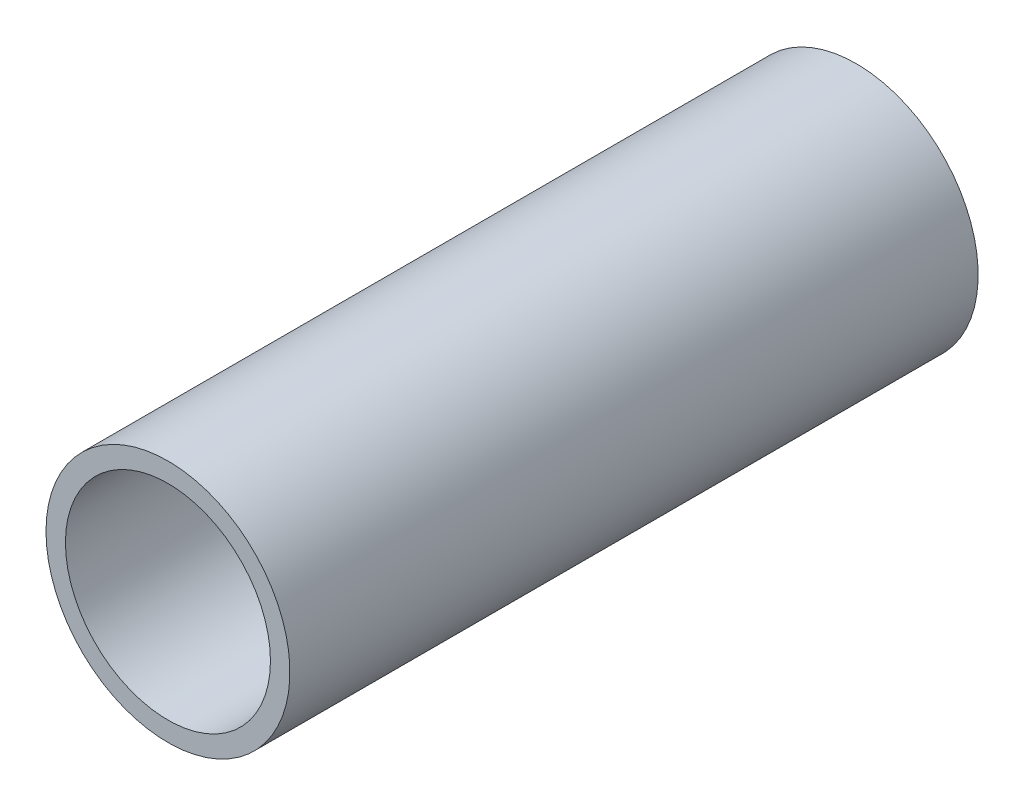
ISO-10303-21;
HEADER;
FILE_DESCRIPTION(('STEP AP214'),'2;1');
FILE_NAME('part.step','',(''),(''),'','','');
FILE_SCHEMA(('AUTOMOTIVE_DESIGN { 1 0 10303 214 1 1 1 1 }'));
ENDSEC;
DATA;
#1=APPLICATION_CONTEXT('core data for automotive mechanical design processes');
#2=APPLICATION_PROTOCOL_DEFINITION('international standard','automotive_design',2000,#1);
#3=PRODUCT_CONTEXT('',#1,'mechanical');
#4=PRODUCT('Part','Part','',(#3));
#5=PRODUCT_RELATED_PRODUCT_CATEGORY('part','',(#4));
#6=PRODUCT_DEFINITION_FORMATION('','',#4);
#7=PRODUCT_DEFINITION_CONTEXT('part definition',#1,'design');
#8=PRODUCT_DEFINITION('design','',#6,#7);
#9=PRODUCT_DEFINITION_SHAPE('','',#8);
#10=(LENGTH_UNIT() NAMED_UNIT(*) SI_UNIT(.MILLI.,.METRE.));
#11=(NAMED_UNIT(*) PLANE_ANGLE_UNIT() SI_UNIT($,.RADIAN.));
#12=(NAMED_UNIT(*) SI_UNIT($,.STERADIAN.) SOLID_ANGLE_UNIT());
#13=UNCERTAINTY_MEASURE_WITH_UNIT(LENGTH_MEASURE(1.E-05),#10,'distance_accuracy_value','');
#14=(GEOMETRIC_REPRESENTATION_CONTEXT(3) GLOBAL_UNCERTAINTY_ASSIGNED_CONTEXT((#13)) GLOBAL_UNIT_ASSIGNED_CONTEXT((#10,
#11,#12)) REPRESENTATION_CONTEXT('',''));
#15=CARTESIAN_POINT('',(0.,0.,0.));
#16=DIRECTION('',(0.,0.,1.));
#17=DIRECTION('',(1.,0.,0.));
#18=AXIS2_PLACEMENT_3D('',#15,#16,#17);
#19=CARTESIAN_POINT('',(0.,0.,26.9875));
#20=DIRECTION('',(0.,0.,-1.));
#21=DIRECTION('',(-1.,0.,0.));
#22=AXIS2_PLACEMENT_3D('',#19,#20,#21);
#23=CYLINDRICAL_SURFACE('',#22,8.0391);
#24=CARTESIAN_POINT('',(0.,0.,-26.9875));
#25=DIRECTION('',(0.,0.,-1.));
#26=DIRECTION('',(-1.,0.,0.));
#27=AXIS2_PLACEMENT_3D('',#24,#25,#26);
#28=CIRCLE('',#27,8.0391);
#29=CARTESIAN_POINT('',(-8.0391,0.,-26.9875));
#30=VERTEX_POINT('',#29);
#31=EDGE_CURVE('E26',#30,#30,#28,.T.);
#32=ORIENTED_EDGE('',*,*,#31,.T.);
#33=EDGE_LOOP('',(#32));
#34=FACE_BOUND('',#33,.T.);
#35=CARTESIAN_POINT('',(0.,0.,26.9875));
#36=DIRECTION('',(0.,0.,-1.));
#37=DIRECTION('',(-1.,0.,0.));
#38=AXIS2_PLACEMENT_3D('',#35,#36,#37);
#39=CIRCLE('',#38,8.0391);
#40=CARTESIAN_POINT('',(-8.0391,0.,26.9875));
#41=VERTEX_POINT('',#40);
#42=EDGE_CURVE('E17',#41,#41,#39,.T.);
#43=ORIENTED_EDGE('',*,*,#42,.F.);
#44=EDGE_LOOP('',(#43));
#45=FACE_BOUND('',#44,.T.);
#46=ADVANCED_FACE('F14',(#34,#45),#23,.F.);
#47=CARTESIAN_POINT('',(0.,0.,26.9875));
#48=DIRECTION('',(0.,0.,1.));
#49=DIRECTION('',(1.,0.,0.));
#50=AXIS2_PLACEMENT_3D('',#47,#48,#49);
#51=PLANE('',#50);
#52=ORIENTED_EDGE('',*,*,#42,.T.);
#53=EDGE_LOOP('',(#52));
#54=FACE_BOUND('',#53,.T.);
#55=CARTESIAN_POINT('',(0.,0.,26.9875));
#56=DIRECTION('',(0.,0.,-1.));
#57=DIRECTION('',(-1.,0.,0.));
#58=AXIS2_PLACEMENT_3D('',#55,#56,#57);
#59=CIRCLE('',#58,9.5631);
#60=CARTESIAN_POINT('',(-9.5631,0.,26.9875));
#61=VERTEX_POINT('',#60);
#62=EDGE_CURVE('E21',#61,#61,#59,.T.);
#63=ORIENTED_EDGE('',*,*,#62,.F.);
#64=EDGE_LOOP('',(#63));
#65=FACE_BOUND('',#64,.T.);
#66=ADVANCED_FACE('F34',(#54,#65),#51,.T.);
#67=CARTESIAN_POINT('',(0.,0.,-26.9875));
#68=DIRECTION('',(0.,0.,1.));
#69=DIRECTION('',(1.,0.,0.));
#70=AXIS2_PLACEMENT_3D('',#67,#68,#69);
#71=PLANE('',#70);
#72=ORIENTED_EDGE('',*,*,#31,.F.);
#73=EDGE_LOOP('',(#72));
#74=FACE_BOUND('',#73,.T.);
#75=CARTESIAN_POINT('',(0.,0.,-26.9875));
#76=DIRECTION('',(0.,0.,-1.));
#77=DIRECTION('',(-1.,0.,0.));
#78=AXIS2_PLACEMENT_3D('',#75,#76,#77);
#79=CIRCLE('',#78,9.5631);
#80=CARTESIAN_POINT('',(-9.5631,0.,-26.9875));
#81=VERTEX_POINT('',#80);
#82=EDGE_CURVE('E10',#81,#81,#79,.F.);
#83=ORIENTED_EDGE('',*,*,#82,.F.);
#84=EDGE_LOOP('',(#83));
#85=FACE_BOUND('',#84,.T.);
#86=ADVANCED_FACE('F42',(#74,#85),#71,.F.);
#87=CARTESIAN_POINT('',(0.,0.,26.9875));
#88=DIRECTION('',(0.,0.,-1.));
#89=DIRECTION('',(-1.,0.,0.));
#90=AXIS2_PLACEMENT_3D('',#87,#88,#89);
#91=CYLINDRICAL_SURFACE('',#90,9.5631);
#92=ORIENTED_EDGE('',*,*,#82,.T.);
#93=EDGE_LOOP('',(#92));
#94=FACE_BOUND('',#93,.T.);
#95=ORIENTED_EDGE('',*,*,#62,.T.);
#96=EDGE_LOOP('',(#95));
#97=FACE_BOUND('',#96,.T.);
#98=ADVANCED_FACE('F43',(#94,#97),#91,.T.);
#99=CLOSED_SHELL('',(#46,#66,#86,#98));
#100=MANIFOLD_SOLID_BREP('B1',#99);
#101=ADVANCED_BREP_SHAPE_REPRESENTATION('',(#18,#100),#14);
#102=SHAPE_DEFINITION_REPRESENTATION(#9,#101);
ENDSEC;
END-ISO-10303-21;
